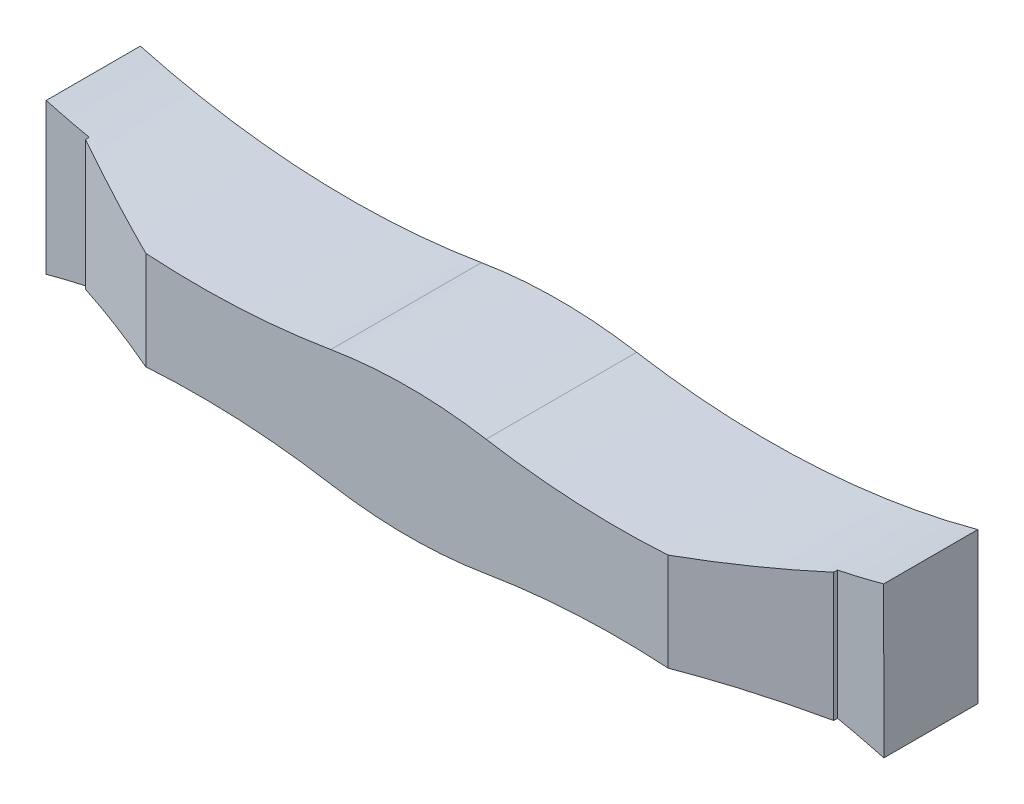
ISO-10303-21;
HEADER;
FILE_DESCRIPTION(('STEP AP214'),'2;1');
FILE_NAME('part.step','',(''),(''),'','','');
FILE_SCHEMA(('AUTOMOTIVE_DESIGN { 1 0 10303 214 1 1 1 1 }'));
ENDSEC;
DATA;
#1=APPLICATION_CONTEXT('core data for automotive mechanical design processes');
#2=APPLICATION_PROTOCOL_DEFINITION('international standard','automotive_design',2000,#1);
#3=PRODUCT_CONTEXT('',#1,'mechanical');
#4=PRODUCT('Part','Part','',(#3));
#5=PRODUCT_RELATED_PRODUCT_CATEGORY('part','',(#4));
#6=PRODUCT_DEFINITION_FORMATION('','',#4);
#7=PRODUCT_DEFINITION_CONTEXT('part definition',#1,'design');
#8=PRODUCT_DEFINITION('design','',#6,#7);
#9=PRODUCT_DEFINITION_SHAPE('','',#8);
#10=(LENGTH_UNIT() NAMED_UNIT(*) SI_UNIT(.MILLI.,.METRE.));
#11=(NAMED_UNIT(*) PLANE_ANGLE_UNIT() SI_UNIT($,.RADIAN.));
#12=(NAMED_UNIT(*) SI_UNIT($,.STERADIAN.) SOLID_ANGLE_UNIT());
#13=UNCERTAINTY_MEASURE_WITH_UNIT(LENGTH_MEASURE(1.E-05),#10,'distance_accuracy_value','');
#14=(GEOMETRIC_REPRESENTATION_CONTEXT(3) GLOBAL_UNCERTAINTY_ASSIGNED_CONTEXT((#13)) GLOBAL_UNIT_ASSIGNED_CONTEXT((#10,
#11,#12)) REPRESENTATION_CONTEXT('',''));
#15=CARTESIAN_POINT('',(0.,0.,0.));
#16=DIRECTION('',(0.,0.,1.));
#17=DIRECTION('',(1.,0.,0.));
#18=AXIS2_PLACEMENT_3D('',#15,#16,#17);
#19=CARTESIAN_POINT('',(0.,0.,11.));
#20=DIRECTION('',(0.,0.,1.));
#21=DIRECTION('',(1.,0.,0.));
#22=AXIS2_PLACEMENT_3D('',#19,#20,#21);
#23=PLANE('',#22);
#24=CARTESIAN_POINT('',(4.48134672518531,-17.9790213143246,11.));
#25=DIRECTION('',(0.,0.,-1.));
#26=DIRECTION('',(-1.,0.,0.));
#27=AXIS2_PLACEMENT_3D('',#24,#25,#26);
#28=CIRCLE('',#27,16.9724615226641);
#29=CARTESIAN_POINT('',(8.9301792600437,-1.6,11.));
#30=VERTEX_POINT('',#29);
#31=CARTESIAN_POINT('',(1.68191223696798,-1.2390208159825,11.));
#32=VERTEX_POINT('',#31);
#33=EDGE_CURVE('E263',#30,#32,#28,.F.);
#34=ORIENTED_EDGE('',*,*,#33,.T.);
#35=CARTESIAN_POINT('',(0.0325141903268939,8.62401553616264,11.));
#36=DIRECTION('',(0.,0.,1.));
#37=DIRECTION('',(1.,0.,0.));
#38=AXIS2_PLACEMENT_3D('',#35,#36,#37);
#39=CIRCLE('',#38,10.);
#40=CARTESIAN_POINT('',(-1.61688385631421,-1.2390208159825,11.));
#41=VERTEX_POINT('',#40);
#42=EDGE_CURVE('E189',#32,#41,#39,.F.);
#43=ORIENTED_EDGE('',*,*,#42,.T.);
#44=CARTESIAN_POINT('',(-4.41631834453156,-17.9790213143246,11.));
#45=DIRECTION('',(0.,0.,-1.));
#46=DIRECTION('',(-1.,0.,0.));
#47=AXIS2_PLACEMENT_3D('',#44,#45,#46);
#48=CIRCLE('',#47,16.9724615226641);
#49=CARTESIAN_POINT('',(-8.86515087939,-1.6,11.));
#50=VERTEX_POINT('',#49);
#51=EDGE_CURVE('E173',#50,#41,#48,.T.);
#52=ORIENTED_EDGE('',*,*,#51,.F.);
#53=DIRECTION('',(1.,0.,0.));
#54=VECTOR('',#53,1.);
#55=CARTESIAN_POINT('',(-8.86980696569023,-1.6,11.));
#56=LINE('',#55,#54);
#57=CARTESIAN_POINT('',(-8.86980696569023,-1.6,11.));
#58=VERTEX_POINT('',#57);
#59=EDGE_CURVE('E187',#58,#50,#56,.T.);
#60=ORIENTED_EDGE('',*,*,#59,.F.);
#61=DIRECTION('',(-0.00145502542859039,-0.999998941449941,0.));
#62=VECTOR('',#61,1.);
#63=CARTESIAN_POINT('',(-8.86515087939004,1.6,11.));
#64=LINE('',#63,#62);
#65=CARTESIAN_POINT('',(-8.86515087939003,1.60000000000002,11.));
#66=VERTEX_POINT('',#65);
#67=EDGE_CURVE('E200',#66,#58,#64,.T.);
#68=ORIENTED_EDGE('',*,*,#67,.F.);
#69=CARTESIAN_POINT('',(-4.41631834453155,17.9790213143246,11.));
#70=DIRECTION('',(0.,0.,-1.));
#71=DIRECTION('',(-1.,0.,0.));
#72=AXIS2_PLACEMENT_3D('',#69,#70,#71);
#73=CIRCLE('',#72,16.9724615226641);
#74=CARTESIAN_POINT('',(-1.61688385631422,1.2390208159825,11.));
#75=VERTEX_POINT('',#74);
#76=EDGE_CURVE('E242',#66,#75,#73,.F.);
#77=ORIENTED_EDGE('',*,*,#76,.T.);
#78=CARTESIAN_POINT('',(0.0325141903268698,-8.62401553616264,11.));
#79=DIRECTION('',(0.,0.,1.));
#80=DIRECTION('',(1.,0.,0.));
#81=AXIS2_PLACEMENT_3D('',#78,#79,#80);
#82=CIRCLE('',#81,10.);
#83=CARTESIAN_POINT('',(1.68191223696799,1.2390208159825,11.));
#84=VERTEX_POINT('',#83);
#85=EDGE_CURVE('E230',#75,#84,#82,.F.);
#86=ORIENTED_EDGE('',*,*,#85,.T.);
#87=CARTESIAN_POINT('',(4.48134672518538,17.9790213143246,11.));
#88=DIRECTION('',(0.,0.,-1.));
#89=DIRECTION('',(-1.,0.,0.));
#90=AXIS2_PLACEMENT_3D('',#87,#88,#89);
#91=CIRCLE('',#90,16.9724615226641);
#92=CARTESIAN_POINT('',(8.93017926004382,1.6,11.));
#93=VERTEX_POINT('',#92);
#94=EDGE_CURVE('E262',#93,#84,#91,.T.);
#95=ORIENTED_EDGE('',*,*,#94,.F.);
#96=DIRECTION('',(-0.00145502542859039,0.999998941449941,0.));
#97=VECTOR('',#96,1.);
#98=CARTESIAN_POINT('',(8.93017926004382,1.6,11.));
#99=LINE('',#98,#97);
#100=CARTESIAN_POINT('',(8.93483534634401,-1.6,11.));
#101=VERTEX_POINT('',#100);
#102=EDGE_CURVE('E195',#101,#93,#99,.T.);
#103=ORIENTED_EDGE('',*,*,#102,.F.);
#104=EDGE_CURVE('E196',#30,#101,#56,.T.);
#105=ORIENTED_EDGE('',*,*,#104,.F.);
#106=EDGE_LOOP('',(#34,#43,#52,#60,#68,#77,#86,#95,#103,#105));
#107=FACE_BOUND('',#106,.T.);
#108=ADVANCED_FACE('F57',(#107),#23,.F.);
#109=CARTESIAN_POINT('',(5.54941082373261,17.5440439225869,14.2000000923872));
#110=DIRECTION('',(0.,0.,1.));
#111=DIRECTION('',(1.,0.,0.));
#112=AXIS2_PLACEMENT_3D('',#109,#110,#111);
#113=PLANE('',#112);
#114=CARTESIAN_POINT('',(-4.41631834453156,-17.9790213143246,14.2000000923872));
#115=DIRECTION('',(0.,0.,-1.));
#116=DIRECTION('',(-1.,0.,0.));
#117=AXIS2_PLACEMENT_3D('',#114,#115,#116);
#118=CIRCLE('',#117,16.9724615226641);
#119=CARTESIAN_POINT('',(-5.54941082373262,-1.0444250223579,14.2000000923872));
#120=VERTEX_POINT('',#119);
#121=CARTESIAN_POINT('',(-1.61688385631421,-1.2390208159825,14.2000000923872));
#122=VERTEX_POINT('',#121);
#123=EDGE_CURVE('E181',#120,#122,#118,.T.);
#124=ORIENTED_EDGE('',*,*,#123,.T.);
#125=CARTESIAN_POINT('',(0.0325141903268939,8.62401553616264,14.2000000923872));
#126=DIRECTION('',(0.,0.,1.));
#127=DIRECTION('',(1.,0.,0.));
#128=AXIS2_PLACEMENT_3D('',#125,#126,#127);
#129=CIRCLE('',#128,10.);
#130=CARTESIAN_POINT('',(1.68191223696798,-1.2390208159825,14.2000000923872));
#131=VERTEX_POINT('',#130);
#132=EDGE_CURVE('E236',#122,#131,#129,.T.);
#133=ORIENTED_EDGE('',*,*,#132,.T.);
#134=CARTESIAN_POINT('',(4.48134672518531,-17.9790213143246,14.2000000923872));
#135=DIRECTION('',(0.,0.,1.));
#136=DIRECTION('',(1.,0.,0.));
#137=AXIS2_PLACEMENT_3D('',#134,#135,#136);
#138=CIRCLE('',#137,16.9724615226641);
#139=CARTESIAN_POINT('',(5.54941082373261,-1.04019935942736,14.2000000923872));
#140=VERTEX_POINT('',#139);
#141=EDGE_CURVE('E225',#131,#140,#138,.F.);
#142=ORIENTED_EDGE('',*,*,#141,.T.);
#143=DIRECTION('',(0.,-1.,0.));
#144=VECTOR('',#143,1.);
#145=CARTESIAN_POINT('',(5.54941082373261,17.5440439225869,14.2000000923872));
#146=LINE('',#145,#144);
#147=CARTESIAN_POINT('',(5.54941082373261,1.04019935942735,14.2000000923872));
#148=VERTEX_POINT('',#147);
#149=EDGE_CURVE('E291',#148,#140,#146,.T.);
#150=ORIENTED_EDGE('',*,*,#149,.F.);
#151=CARTESIAN_POINT('',(4.48134672518538,17.9790213143246,14.2000000923872));
#152=DIRECTION('',(0.,0.,1.));
#153=DIRECTION('',(1.,0.,0.));
#154=AXIS2_PLACEMENT_3D('',#151,#152,#153);
#155=CIRCLE('',#154,16.9724615226641);
#156=CARTESIAN_POINT('',(1.68191223696799,1.2390208159825,14.2000000923872));
#157=VERTEX_POINT('',#156);
#158=EDGE_CURVE('E216',#157,#148,#155,.T.);
#159=ORIENTED_EDGE('',*,*,#158,.F.);
#160=CARTESIAN_POINT('',(0.0325141903268698,-8.62401553616264,14.2000000923872));
#161=DIRECTION('',(0.,0.,1.));
#162=DIRECTION('',(1.,0.,0.));
#163=AXIS2_PLACEMENT_3D('',#160,#161,#162);
#164=CIRCLE('',#163,10.);
#165=CARTESIAN_POINT('',(-1.61688385631422,1.2390208159825,14.2000000923872));
#166=VERTEX_POINT('',#165);
#167=EDGE_CURVE('E72',#157,#166,#164,.T.);
#168=ORIENTED_EDGE('',*,*,#167,.T.);
#169=CARTESIAN_POINT('',(-4.41631834453155,17.9790213143246,14.2000000923872));
#170=DIRECTION('',(0.,0.,-1.));
#171=DIRECTION('',(-1.,0.,0.));
#172=AXIS2_PLACEMENT_3D('',#169,#170,#171);
#173=CIRCLE('',#172,16.9724615226641);
#174=CARTESIAN_POINT('',(-5.54941082373262,1.0444250223579,14.2000000923872));
#175=VERTEX_POINT('',#174);
#176=EDGE_CURVE('E190',#175,#166,#173,.F.);
#177=ORIENTED_EDGE('',*,*,#176,.F.);
#178=DIRECTION('',(0.,-1.,0.));
#179=VECTOR('',#178,1.);
#180=CARTESIAN_POINT('',(-5.54941082373262,17.5440439225869,14.2000000923872));
#181=LINE('',#180,#179);
#182=EDGE_CURVE('E288',#175,#120,#181,.T.);
#183=ORIENTED_EDGE('',*,*,#182,.T.);
#184=EDGE_LOOP('',(#124,#133,#142,#150,#159,#168,#177,#183));
#185=FACE_BOUND('',#184,.T.);
#186=ADVANCED_FACE('F314',(#185),#113,.T.);
#187=CARTESIAN_POINT('',(0.,0.,13.));
#188=DIRECTION('',(0.,0.,1.));
#189=DIRECTION('',(1.,0.,0.));
#190=AXIS2_PLACEMENT_3D('',#187,#188,#189);
#191=PLANE('',#190);
#192=CARTESIAN_POINT('',(-4.41631834453156,-17.9790213143246,13.));
#193=DIRECTION('',(0.,0.,1.));
#194=DIRECTION('',(1.,0.,0.));
#195=AXIS2_PLACEMENT_3D('',#192,#193,#194);
#196=CIRCLE('',#195,16.9724615226641);
#197=CARTESIAN_POINT('',(-7.9494109377265,-1.37836750592821,13.0000002682209));
#198=VERTEX_POINT('',#197);
#199=CARTESIAN_POINT('',(-8.86515087939,-1.6,13.));
#200=VERTEX_POINT('',#199);
#201=EDGE_CURVE('E176',#198,#200,#196,.T.);
#202=ORIENTED_EDGE('',*,*,#201,.F.);
#203=DIRECTION('',(0.,-1.,0.));
#204=VECTOR('',#203,1.);
#205=CARTESIAN_POINT('',(-7.9494109377265,17.5440439225869,13.0000002682209));
#206=LINE('',#205,#204);
#207=CARTESIAN_POINT('',(-7.9494109377265,1.37836750592822,13.0000002682209));
#208=VERTEX_POINT('',#207);
#209=EDGE_CURVE('E208',#208,#198,#206,.T.);
#210=ORIENTED_EDGE('',*,*,#209,.F.);
#211=CARTESIAN_POINT('',(-4.41631834453155,17.9790213143246,13.));
#212=DIRECTION('',(0.,0.,1.));
#213=DIRECTION('',(1.,0.,0.));
#214=AXIS2_PLACEMENT_3D('',#211,#212,#213);
#215=CIRCLE('',#214,16.9724615226641);
#216=CARTESIAN_POINT('',(-8.86515087939003,1.60000000000002,13.));
#217=VERTEX_POINT('',#216);
#218=EDGE_CURVE('E259',#208,#217,#215,.F.);
#219=ORIENTED_EDGE('',*,*,#218,.T.);
#220=DIRECTION('',(-0.00145502542859039,-0.999998941449941,0.));
#221=VECTOR('',#220,1.);
#222=CARTESIAN_POINT('',(-8.86515087939004,1.6,13.));
#223=LINE('',#222,#221);
#224=CARTESIAN_POINT('',(-8.86980696569023,-1.6,13.));
#225=VERTEX_POINT('',#224);
#226=EDGE_CURVE('E204',#217,#225,#223,.T.);
#227=ORIENTED_EDGE('',*,*,#226,.T.);
#228=DIRECTION('',(1.,0.,0.));
#229=VECTOR('',#228,1.);
#230=CARTESIAN_POINT('',(8.26812233833673,-1.6,13.));
#231=LINE('',#230,#229);
#232=EDGE_CURVE('E209',#225,#200,#231,.T.);
#233=ORIENTED_EDGE('',*,*,#232,.T.);
#234=EDGE_LOOP('',(#202,#210,#219,#227,#233));
#235=FACE_BOUND('',#234,.T.);
#236=ADVANCED_FACE('F305',(#235),#191,.T.);
#237=CARTESIAN_POINT('',(-7.9494109377265,17.5440439225869,13.0808623507619));
#238=DIRECTION('',(-0.422618047373337,0.,0.906307886997762));
#239=DIRECTION('',(0.906307886997762,0.,0.422618047373337));
#240=AXIS2_PLACEMENT_3D('',#237,#238,#239);
#241=PLANE('',#240);
#242=CARTESIAN_POINT('',(-4.41631834453156,-17.9790213143246,14.7283694665517));
#243=DIRECTION('',(-0.422618047373337,0.,0.906307886997762));
#244=DIRECTION('',(-0.906307886997762,0.,-0.422618047373337));
#245=AXIS2_PLACEMENT_3D('',#242,#243,#244);
#246=ELLIPSE('',#245,18.7270372090517,16.9724615226641);
#247=CARTESIAN_POINT('',(-7.9494109377265,-1.37836750592821,13.0808623507619));
#248=VERTEX_POINT('',#247);
#249=EDGE_CURVE('E250',#120,#248,#246,.T.);
#250=ORIENTED_EDGE('',*,*,#249,.F.);
#251=ORIENTED_EDGE('',*,*,#182,.F.);
#252=CARTESIAN_POINT('',(-4.41631834453155,17.9790213143246,14.7283694665517));
#253=DIRECTION('',(-0.422618047373337,0.,0.906307886997762));
#254=DIRECTION('',(-0.906307886997762,0.,-0.422618047373337));
#255=AXIS2_PLACEMENT_3D('',#252,#253,#254);
#256=ELLIPSE('',#255,18.7270372090517,16.9724615226641);
#257=CARTESIAN_POINT('',(-7.9494109377265,1.37836750592822,13.0808623507619));
#258=VERTEX_POINT('',#257);
#259=EDGE_CURVE('E256',#175,#258,#256,.F.);
#260=ORIENTED_EDGE('',*,*,#259,.T.);
#261=DIRECTION('',(0.,-1.,0.));
#262=VECTOR('',#261,1.);
#263=CARTESIAN_POINT('',(-7.9494109377265,17.5440439225869,13.0808623507619));
#264=LINE('',#263,#262);
#265=EDGE_CURVE('E285',#258,#248,#264,.T.);
#266=ORIENTED_EDGE('',*,*,#265,.T.);
#267=EDGE_LOOP('',(#250,#251,#260,#266));
#268=FACE_BOUND('',#267,.T.);
#269=ADVANCED_FACE('F312',(#268),#241,.T.);
#270=CARTESIAN_POINT('',(-7.9494109377265,17.5440439225869,13.0808623507619));
#271=DIRECTION('',(-1.,0.,0.));
#272=DIRECTION('',(0.,0.,1.));
#273=AXIS2_PLACEMENT_3D('',#270,#271,#272);
#274=PLANE('',#273);
#275=DIRECTION('',(0.,0.,-1.));
#276=VECTOR('',#275,1.);
#277=CARTESIAN_POINT('',(-7.9494109377265,-1.37836750592821,14.2000000923872));
#278=LINE('',#277,#276);
#279=EDGE_CURVE('E180',#248,#198,#278,.T.);
#280=ORIENTED_EDGE('',*,*,#279,.F.);
#281=ORIENTED_EDGE('',*,*,#265,.F.);
#282=DIRECTION('',(0.,0.,-1.));
#283=VECTOR('',#282,1.);
#284=CARTESIAN_POINT('',(-7.9494109377265,1.37836750592822,14.2000000923872));
#285=LINE('',#284,#283);
#286=EDGE_CURVE('E253',#258,#208,#285,.T.);
#287=ORIENTED_EDGE('',*,*,#286,.T.);
#288=ORIENTED_EDGE('',*,*,#209,.T.);
#289=EDGE_LOOP('',(#280,#281,#287,#288));
#290=FACE_BOUND('',#289,.T.);
#291=ADVANCED_FACE('F302',(#290),#274,.T.);
#292=DIRECTION('',(0.,-1.,0.));
#293=VECTOR('',#292,1.);
#294=CARTESIAN_POINT('',(7.9494109377265,17.5440439225869,13.0000002682209));
#295=LINE('',#294,#293);
#296=CARTESIAN_POINT('',(7.9494109377265,1.36466063580296,13.0000002682209));
#297=VERTEX_POINT('',#296);
#298=CARTESIAN_POINT('',(7.9494109377265,-1.36466063580298,13.0000002682209));
#299=VERTEX_POINT('',#298);
#300=EDGE_CURVE('E284',#297,#299,#295,.T.);
#301=ORIENTED_EDGE('',*,*,#300,.T.);
#302=CARTESIAN_POINT('',(4.48134672518531,-17.9790213143246,13.));
#303=DIRECTION('',(0.,0.,1.));
#304=DIRECTION('',(1.,0.,0.));
#305=AXIS2_PLACEMENT_3D('',#302,#303,#304);
#306=CIRCLE('',#305,16.9724615226641);
#307=CARTESIAN_POINT('',(8.9301792600437,-1.6,13.));
#308=VERTEX_POINT('',#307);
#309=EDGE_CURVE('E281',#299,#308,#306,.F.);
#310=ORIENTED_EDGE('',*,*,#309,.T.);
#311=CARTESIAN_POINT('',(8.93483534634401,-1.6,13.));
#312=VERTEX_POINT('',#311);
#313=EDGE_CURVE('E207',#308,#312,#231,.T.);
#314=ORIENTED_EDGE('',*,*,#313,.T.);
#315=DIRECTION('',(-0.00145502542859039,0.999998941449941,0.));
#316=VECTOR('',#315,1.);
#317=CARTESIAN_POINT('',(8.93017926004382,1.6,13.));
#318=LINE('',#317,#316);
#319=CARTESIAN_POINT('',(8.93017926004382,1.6,13.));
#320=VERTEX_POINT('',#319);
#321=EDGE_CURVE('E211',#312,#320,#318,.T.);
#322=ORIENTED_EDGE('',*,*,#321,.T.);
#323=CARTESIAN_POINT('',(4.48134672518538,17.9790213143246,13.));
#324=DIRECTION('',(0.,0.,1.));
#325=DIRECTION('',(1.,0.,0.));
#326=AXIS2_PLACEMENT_3D('',#323,#324,#325);
#327=CIRCLE('',#326,16.9724615226641);
#328=EDGE_CURVE('E273',#297,#320,#327,.T.);
#329=ORIENTED_EDGE('',*,*,#328,.F.);
#330=EDGE_LOOP('',(#301,#310,#314,#322,#329));
#331=FACE_BOUND('',#330,.T.);
#332=ADVANCED_FACE('F335',(#331),#191,.T.);
#333=CARTESIAN_POINT('',(8.26812233833673,-1.6,11.));
#334=DIRECTION('',(0.,-1.,0.));
#335=DIRECTION('',(1.,0.,0.));
#336=AXIS2_PLACEMENT_3D('',#333,#334,#335);
#337=PLANE('',#336);
#338=DIRECTION('',(0.,0.,-1.));
#339=VECTOR('',#338,1.);
#340=CARTESIAN_POINT('',(-8.86515087939,-1.6,14.2000000923872));
#341=LINE('',#340,#339);
#342=EDGE_CURVE('E170',#200,#50,#341,.T.);
#343=ORIENTED_EDGE('',*,*,#342,.F.);
#344=ORIENTED_EDGE('',*,*,#232,.F.);
#345=DIRECTION('',(0.,0.,1.));
#346=VECTOR('',#345,1.);
#347=CARTESIAN_POINT('',(-8.86980696569023,-1.6,11.));
#348=LINE('',#347,#346);
#349=EDGE_CURVE('E194',#58,#225,#348,.T.);
#350=ORIENTED_EDGE('',*,*,#349,.F.);
#351=ORIENTED_EDGE('',*,*,#59,.T.);
#352=EDGE_LOOP('',(#343,#344,#350,#351));
#353=FACE_BOUND('',#352,.T.);
#354=ADVANCED_FACE('F192',(#353),#337,.T.);
#355=ORIENTED_EDGE('',*,*,#313,.F.);
#356=DIRECTION('',(0.,0.,-1.));
#357=VECTOR('',#356,1.);
#358=CARTESIAN_POINT('',(8.9301792600437,-1.6,14.2000000923872));
#359=LINE('',#358,#357);
#360=EDGE_CURVE('E265',#308,#30,#359,.T.);
#361=ORIENTED_EDGE('',*,*,#360,.T.);
#362=ORIENTED_EDGE('',*,*,#104,.T.);
#363=DIRECTION('',(0.,0.,1.));
#364=VECTOR('',#363,1.);
#365=CARTESIAN_POINT('',(8.93483534634401,-1.6,11.));
#366=LINE('',#365,#364);
#367=EDGE_CURVE('E220',#101,#312,#366,.T.);
#368=ORIENTED_EDGE('',*,*,#367,.T.);
#369=EDGE_LOOP('',(#355,#361,#362,#368));
#370=FACE_BOUND('',#369,.T.);
#371=ADVANCED_FACE('F329',(#370),#337,.T.);
#372=CARTESIAN_POINT('',(7.9494109377265,17.5440439225869,13.0000002682209));
#373=DIRECTION('',(1.,0.,0.));
#374=DIRECTION('',(0.,0.,-1.));
#375=AXIS2_PLACEMENT_3D('',#372,#373,#374);
#376=PLANE('',#375);
#377=DIRECTION('',(0.,-1.,0.));
#378=VECTOR('',#377,1.);
#379=CARTESIAN_POINT('',(7.9494109377265,17.5440439225869,13.0808623507619));
#380=LINE('',#379,#378);
#381=CARTESIAN_POINT('',(7.9494109377265,1.36466063580296,13.0808623507619));
#382=VERTEX_POINT('',#381);
#383=CARTESIAN_POINT('',(7.9494109377265,-1.36466063580298,13.0808623507619));
#384=VERTEX_POINT('',#383);
#385=EDGE_CURVE('E294',#382,#384,#380,.T.);
#386=ORIENTED_EDGE('',*,*,#385,.T.);
#387=DIRECTION('',(0.,0.,-1.));
#388=VECTOR('',#387,1.);
#389=CARTESIAN_POINT('',(7.9494109377265,-1.36466063580298,14.2000000923872));
#390=LINE('',#389,#388);
#391=EDGE_CURVE('E278',#384,#299,#390,.T.);
#392=ORIENTED_EDGE('',*,*,#391,.T.);
#393=ORIENTED_EDGE('',*,*,#300,.F.);
#394=DIRECTION('',(0.,0.,-1.));
#395=VECTOR('',#394,1.);
#396=CARTESIAN_POINT('',(7.9494109377265,1.36466063580296,14.2000000923872));
#397=LINE('',#396,#395);
#398=EDGE_CURVE('E271',#382,#297,#397,.T.);
#399=ORIENTED_EDGE('',*,*,#398,.F.);
#400=EDGE_LOOP('',(#386,#392,#393,#399));
#401=FACE_BOUND('',#400,.T.);
#402=ADVANCED_FACE('F338',(#401),#376,.T.);
#403=CARTESIAN_POINT('',(7.9494109377265,17.5440439225869,13.0808623507619));
#404=DIRECTION('',(0.422618047373337,0.,0.906307886997762));
#405=DIRECTION('',(0.906307886997762,0.,-0.422618047373337));
#406=AXIS2_PLACEMENT_3D('',#403,#404,#405);
#407=PLANE('',#406);
#408=ORIENTED_EDGE('',*,*,#149,.T.);
#409=CARTESIAN_POINT('',(4.48134672518531,-17.9790213143246,14.698046253381));
#410=DIRECTION('',(0.422618047373337,0.,0.906307886997762));
#411=DIRECTION('',(0.906307886997762,0.,-0.422618047373337));
#412=AXIS2_PLACEMENT_3D('',#409,#410,#411);
#413=ELLIPSE('',#412,18.7270372090517,16.9724615226641);
#414=EDGE_CURVE('E275',#140,#384,#413,.F.);
#415=ORIENTED_EDGE('',*,*,#414,.T.);
#416=ORIENTED_EDGE('',*,*,#385,.F.);
#417=CARTESIAN_POINT('',(4.48134672518538,17.9790213143246,14.698046253381));
#418=DIRECTION('',(0.422618047373337,0.,0.906307886997762));
#419=DIRECTION('',(0.906307886997762,0.,-0.422618047373337));
#420=AXIS2_PLACEMENT_3D('',#417,#418,#419);
#421=ELLIPSE('',#420,18.7270372090517,16.9724615226641);
#422=EDGE_CURVE('E268',#148,#382,#421,.T.);
#423=ORIENTED_EDGE('',*,*,#422,.F.);
#424=EDGE_LOOP('',(#408,#415,#416,#423));
#425=FACE_BOUND('',#424,.T.);
#426=ADVANCED_FACE('F343',(#425),#407,.T.);
#427=CARTESIAN_POINT('',(-8.86515087939004,1.6,11.));
#428=DIRECTION('',(-0.999998941449941,0.00145502542859039,0.));
#429=DIRECTION('',(-0.00145502542859039,-0.999998941449941,0.));
#430=AXIS2_PLACEMENT_3D('',#427,#428,#429);
#431=PLANE('',#430);
#432=ORIENTED_EDGE('',*,*,#226,.F.);
#433=DIRECTION('',(0.,0.,1.));
#434=VECTOR('',#433,1.);
#435=CARTESIAN_POINT('',(-8.86515087939004,1.6,11.));
#436=LINE('',#435,#434);
#437=EDGE_CURVE('E214',#66,#217,#436,.T.);
#438=ORIENTED_EDGE('',*,*,#437,.F.);
#439=ORIENTED_EDGE('',*,*,#67,.T.);
#440=ORIENTED_EDGE('',*,*,#349,.T.);
#441=EDGE_LOOP('',(#432,#438,#439,#440));
#442=FACE_BOUND('',#441,.T.);
#443=ADVANCED_FACE('F308',(#442),#431,.T.);
#444=CARTESIAN_POINT('',(8.93017926004382,1.6,11.));
#445=DIRECTION('',(0.999998941449941,0.00145502542859039,0.));
#446=DIRECTION('',(-0.00145502542859039,0.999998941449941,0.));
#447=AXIS2_PLACEMENT_3D('',#444,#445,#446);
#448=PLANE('',#447);
#449=ORIENTED_EDGE('',*,*,#321,.F.);
#450=ORIENTED_EDGE('',*,*,#367,.F.);
#451=ORIENTED_EDGE('',*,*,#102,.T.);
#452=DIRECTION('',(0.,0.,1.));
#453=VECTOR('',#452,1.);
#454=CARTESIAN_POINT('',(8.93017926004382,1.6,11.));
#455=LINE('',#454,#453);
#456=EDGE_CURVE('E217',#93,#320,#455,.T.);
#457=ORIENTED_EDGE('',*,*,#456,.T.);
#458=EDGE_LOOP('',(#449,#450,#451,#457));
#459=FACE_BOUND('',#458,.T.);
#460=ADVANCED_FACE('F332',(#459),#448,.T.);
#461=CARTESIAN_POINT('',(4.48134672518538,17.9790213143246,14.2000000923872));
#462=DIRECTION('',(0.,0.,-1.));
#463=DIRECTION('',(-1.,0.,0.));
#464=AXIS2_PLACEMENT_3D('',#461,#462,#463);
#465=CYLINDRICAL_SURFACE('',#464,16.9724615226641);
#466=ORIENTED_EDGE('',*,*,#94,.T.);
#467=DIRECTION('',(0.,0.,-1.));
#468=VECTOR('',#467,1.);
#469=CARTESIAN_POINT('',(1.68191223696799,1.2390208159825,14.2000000923872));
#470=LINE('',#469,#468);
#471=EDGE_CURVE('E12',#84,#157,#470,.F.);
#472=ORIENTED_EDGE('',*,*,#471,.T.);
#473=ORIENTED_EDGE('',*,*,#158,.T.);
#474=ORIENTED_EDGE('',*,*,#422,.T.);
#475=ORIENTED_EDGE('',*,*,#398,.T.);
#476=ORIENTED_EDGE('',*,*,#328,.T.);
#477=ORIENTED_EDGE('',*,*,#456,.F.);
#478=EDGE_LOOP('',(#466,#472,#473,#474,#475,#476,#477));
#479=FACE_BOUND('',#478,.T.);
#480=ADVANCED_FACE('F362',(#479),#465,.F.);
#481=CARTESIAN_POINT('',(4.48134672518531,-17.9790213143246,14.2000000923872));
#482=DIRECTION('',(0.,0.,-1.));
#483=DIRECTION('',(-1.,0.,0.));
#484=AXIS2_PLACEMENT_3D('',#481,#482,#483);
#485=CYLINDRICAL_SURFACE('',#484,16.9724615226641);
#486=ORIENTED_EDGE('',*,*,#141,.F.);
#487=DIRECTION('',(0.,0.,-1.));
#488=VECTOR('',#487,1.);
#489=CARTESIAN_POINT('',(1.68191223696798,-1.2390208159825,14.2000000923872));
#490=LINE('',#489,#488);
#491=EDGE_CURVE('E227',#131,#32,#490,.T.);
#492=ORIENTED_EDGE('',*,*,#491,.T.);
#493=ORIENTED_EDGE('',*,*,#33,.F.);
#494=ORIENTED_EDGE('',*,*,#360,.F.);
#495=ORIENTED_EDGE('',*,*,#309,.F.);
#496=ORIENTED_EDGE('',*,*,#391,.F.);
#497=ORIENTED_EDGE('',*,*,#414,.F.);
#498=EDGE_LOOP('',(#486,#492,#493,#494,#495,#496,#497));
#499=FACE_BOUND('',#498,.T.);
#500=ADVANCED_FACE('F322',(#499),#485,.F.);
#501=CARTESIAN_POINT('',(-4.41631834453156,-17.9790213143246,14.2000000923872));
#502=DIRECTION('',(0.,0.,-1.));
#503=DIRECTION('',(-1.,0.,0.));
#504=AXIS2_PLACEMENT_3D('',#501,#502,#503);
#505=CYLINDRICAL_SURFACE('',#504,16.9724615226641);
#506=ORIENTED_EDGE('',*,*,#51,.T.);
#507=DIRECTION('',(0.,0.,-1.));
#508=VECTOR('',#507,1.);
#509=CARTESIAN_POINT('',(-1.61688385631421,-1.2390208159825,14.2000000923872));
#510=LINE('',#509,#508);
#511=EDGE_CURVE('E233',#41,#122,#510,.F.);
#512=ORIENTED_EDGE('',*,*,#511,.T.);
#513=ORIENTED_EDGE('',*,*,#123,.F.);
#514=ORIENTED_EDGE('',*,*,#249,.T.);
#515=ORIENTED_EDGE('',*,*,#279,.T.);
#516=ORIENTED_EDGE('',*,*,#201,.T.);
#517=ORIENTED_EDGE('',*,*,#342,.T.);
#518=EDGE_LOOP('',(#506,#512,#513,#514,#515,#516,#517));
#519=FACE_BOUND('',#518,.T.);
#520=ADVANCED_FACE('F172',(#519),#505,.F.);
#521=CARTESIAN_POINT('',(-4.41631834453155,17.9790213143246,14.2000000923872));
#522=DIRECTION('',(0.,0.,-1.));
#523=DIRECTION('',(-1.,0.,0.));
#524=AXIS2_PLACEMENT_3D('',#521,#522,#523);
#525=CYLINDRICAL_SURFACE('',#524,16.9724615226641);
#526=ORIENTED_EDGE('',*,*,#176,.T.);
#527=DIRECTION('',(0.,0.,-1.));
#528=VECTOR('',#527,1.);
#529=CARTESIAN_POINT('',(-1.61688385631422,1.2390208159825,14.2000000923872));
#530=LINE('',#529,#528);
#531=EDGE_CURVE('E65',#166,#75,#530,.T.);
#532=ORIENTED_EDGE('',*,*,#531,.T.);
#533=ORIENTED_EDGE('',*,*,#76,.F.);
#534=ORIENTED_EDGE('',*,*,#437,.T.);
#535=ORIENTED_EDGE('',*,*,#218,.F.);
#536=ORIENTED_EDGE('',*,*,#286,.F.);
#537=ORIENTED_EDGE('',*,*,#259,.F.);
#538=EDGE_LOOP('',(#526,#532,#533,#534,#535,#536,#537));
#539=FACE_BOUND('',#538,.T.);
#540=ADVANCED_FACE('F241',(#539),#525,.F.);
#541=CARTESIAN_POINT('',(0.0325141903268939,8.62401553616264,14.2000000923872));
#542=DIRECTION('',(0.,0.,-1.));
#543=DIRECTION('',(-1.,0.,0.));
#544=AXIS2_PLACEMENT_3D('',#541,#542,#543);
#545=CYLINDRICAL_SURFACE('',#544,10.);
#546=ORIENTED_EDGE('',*,*,#132,.F.);
#547=ORIENTED_EDGE('',*,*,#511,.F.);
#548=ORIENTED_EDGE('',*,*,#42,.F.);
#549=ORIENTED_EDGE('',*,*,#491,.F.);
#550=EDGE_LOOP('',(#546,#547,#548,#549));
#551=FACE_BOUND('',#550,.T.);
#552=ADVANCED_FACE('F320',(#551),#545,.T.);
#553=CARTESIAN_POINT('',(0.0325141903268698,-8.62401553616264,14.2000000923872));
#554=DIRECTION('',(0.,0.,-1.));
#555=DIRECTION('',(-1.,0.,0.));
#556=AXIS2_PLACEMENT_3D('',#553,#554,#555);
#557=CYLINDRICAL_SURFACE('',#556,10.);
#558=ORIENTED_EDGE('',*,*,#167,.F.);
#559=ORIENTED_EDGE('',*,*,#471,.F.);
#560=ORIENTED_EDGE('',*,*,#85,.F.);
#561=ORIENTED_EDGE('',*,*,#531,.F.);
#562=EDGE_LOOP('',(#558,#559,#560,#561));
#563=FACE_BOUND('',#562,.T.);
#564=ADVANCED_FACE('F59',(#563),#557,.T.);
#565=CLOSED_SHELL('',(#108,#186,#236,#269,#291,#332,#354,#371,#402,#426,#443,#460,#480,#500,
#520,#540,#552,#564));
#566=MANIFOLD_SOLID_BREP('B2',#565);
#567=ADVANCED_BREP_SHAPE_REPRESENTATION('',(#18,#566),#14);
#568=SHAPE_DEFINITION_REPRESENTATION(#9,#567);
ENDSEC;
END-ISO-10303-21;
